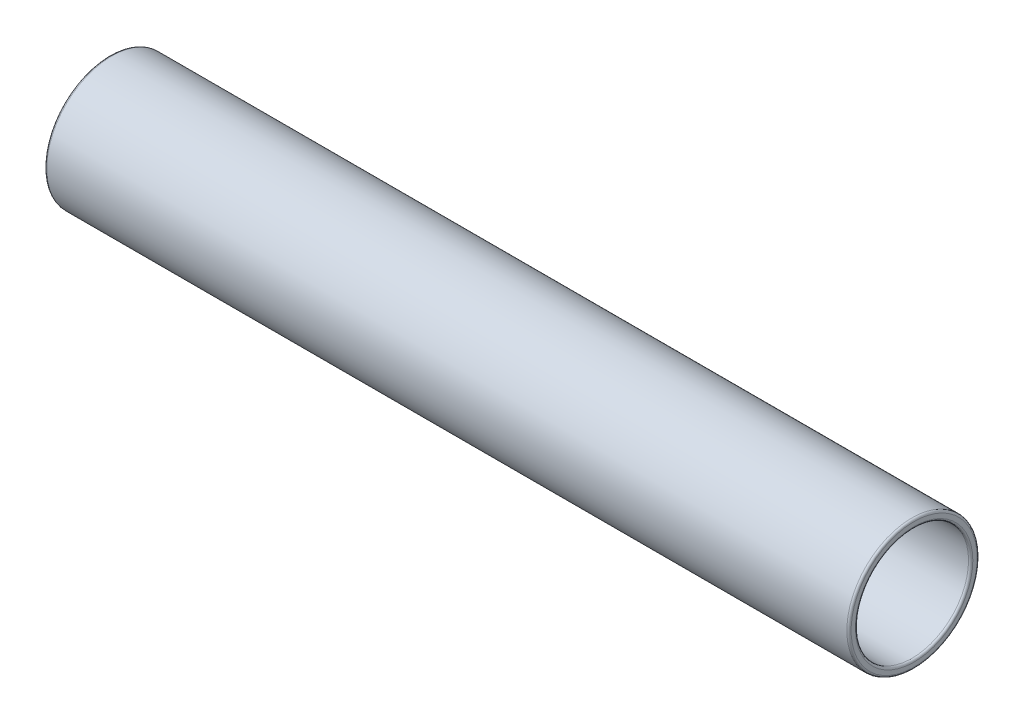
ISO-10303-21;
HEADER;
FILE_DESCRIPTION(('STEP AP214'),'2;1');
FILE_NAME('part.step','',(''),(''),'','','');
FILE_SCHEMA(('AUTOMOTIVE_DESIGN { 1 0 10303 214 1 1 1 1 }'));
ENDSEC;
DATA;
#1=APPLICATION_CONTEXT('core data for automotive mechanical design processes');
#2=APPLICATION_PROTOCOL_DEFINITION('international standard','automotive_design',2000,#1);
#3=PRODUCT_CONTEXT('',#1,'mechanical');
#4=PRODUCT('Part','Part','',(#3));
#5=PRODUCT_RELATED_PRODUCT_CATEGORY('part','',(#4));
#6=PRODUCT_DEFINITION_FORMATION('','',#4);
#7=PRODUCT_DEFINITION_CONTEXT('part definition',#1,'design');
#8=PRODUCT_DEFINITION('design','',#6,#7);
#9=PRODUCT_DEFINITION_SHAPE('','',#8);
#10=(LENGTH_UNIT() NAMED_UNIT(*) SI_UNIT(.MILLI.,.METRE.));
#11=(NAMED_UNIT(*) PLANE_ANGLE_UNIT() SI_UNIT($,.RADIAN.));
#12=(NAMED_UNIT(*) SI_UNIT($,.STERADIAN.) SOLID_ANGLE_UNIT());
#13=UNCERTAINTY_MEASURE_WITH_UNIT(LENGTH_MEASURE(1.E-05),#10,'distance_accuracy_value','');
#14=(GEOMETRIC_REPRESENTATION_CONTEXT(3) GLOBAL_UNCERTAINTY_ASSIGNED_CONTEXT((#13)) GLOBAL_UNIT_ASSIGNED_CONTEXT((#10,
#11,#12)) REPRESENTATION_CONTEXT('',''));
#15=CARTESIAN_POINT('',(0.,0.,0.));
#16=DIRECTION('',(0.,0.,1.));
#17=DIRECTION('',(1.,0.,0.));
#18=AXIS2_PLACEMENT_3D('',#15,#16,#17);
#19=CARTESIAN_POINT('',(750.,0.,0.));
#20=DIRECTION('',(1.,0.,0.));
#21=DIRECTION('',(0.,0.,-1.));
#22=AXIS2_PLACEMENT_3D('',#19,#20,#21);
#23=PLANE('',#22);
#24=CARTESIAN_POINT('',(750.,0.,0.));
#25=DIRECTION('',(1.,0.,0.));
#26=DIRECTION('',(0.,0.,-1.));
#27=AXIS2_PLACEMENT_3D('',#24,#25,#26);
#28=CIRCLE('',#27,54.75);
#29=CARTESIAN_POINT('',(750.,0.,-54.75));
#30=VERTEX_POINT('',#29);
#31=EDGE_CURVE('E65',#30,#30,#28,.F.);
#32=ORIENTED_EDGE('',*,*,#31,.T.);
#33=EDGE_LOOP('',(#32));
#34=FACE_BOUND('',#33,.T.);
#35=CARTESIAN_POINT('',(750.,0.,0.));
#36=DIRECTION('',(1.,0.,0.));
#37=DIRECTION('',(0.,0.,-1.));
#38=AXIS2_PLACEMENT_3D('',#35,#36,#37);
#39=CIRCLE('',#38,58.75);
#40=CARTESIAN_POINT('',(750.,0.,-58.75));
#41=VERTEX_POINT('',#40);
#42=EDGE_CURVE('E69',#41,#41,#39,.T.);
#43=ORIENTED_EDGE('',*,*,#42,.T.);
#44=EDGE_LOOP('',(#43));
#45=FACE_BOUND('',#44,.T.);
#46=ADVANCED_FACE('F37',(#34,#45),#23,.T.);
#47=CARTESIAN_POINT('',(0.,0.,0.));
#48=DIRECTION('',(1.,0.,0.));
#49=DIRECTION('',(0.,0.,-1.));
#50=AXIS2_PLACEMENT_3D('',#47,#48,#49);
#51=PLANE('',#50);
#52=CARTESIAN_POINT('',(0.,0.,0.));
#53=DIRECTION('',(1.,0.,0.));
#54=DIRECTION('',(0.,0.,-1.));
#55=AXIS2_PLACEMENT_3D('',#52,#53,#54);
#56=CIRCLE('',#55,54.75);
#57=CARTESIAN_POINT('',(0.,0.,-54.75));
#58=VERTEX_POINT('',#57);
#59=EDGE_CURVE('E50',#58,#58,#56,.T.);
#60=ORIENTED_EDGE('',*,*,#59,.T.);
#61=EDGE_LOOP('',(#60));
#62=FACE_BOUND('',#61,.T.);
#63=CARTESIAN_POINT('',(0.,0.,0.));
#64=DIRECTION('',(1.,0.,0.));
#65=DIRECTION('',(0.,0.,-1.));
#66=AXIS2_PLACEMENT_3D('',#63,#64,#65);
#67=CIRCLE('',#66,58.75);
#68=CARTESIAN_POINT('',(0.,0.,-58.75));
#69=VERTEX_POINT('',#68);
#70=EDGE_CURVE('E55',#69,#69,#67,.F.);
#71=ORIENTED_EDGE('',*,*,#70,.T.);
#72=EDGE_LOOP('',(#71));
#73=FACE_BOUND('',#72,.T.);
#74=ADVANCED_FACE('F97',(#62,#73),#51,.F.);
#75=CARTESIAN_POINT('',(750.,0.,0.));
#76=DIRECTION('',(-1.,0.,0.));
#77=DIRECTION('',(0.,0.,1.));
#78=AXIS2_PLACEMENT_3D('',#75,#76,#77);
#79=CYLINDRICAL_SURFACE('',#78,60.75);
#80=CARTESIAN_POINT('',(2.,0.,0.));
#81=DIRECTION('',(1.,0.,0.));
#82=DIRECTION('',(0.,0.,-1.));
#83=AXIS2_PLACEMENT_3D('',#80,#81,#82);
#84=CIRCLE('',#83,60.75);
#85=CARTESIAN_POINT('',(2.,0.,-60.75));
#86=VERTEX_POINT('',#85);
#87=EDGE_CURVE('E10',#86,#86,#84,.T.);
#88=ORIENTED_EDGE('',*,*,#87,.T.);
#89=EDGE_LOOP('',(#88));
#90=FACE_BOUND('',#89,.T.);
#91=CARTESIAN_POINT('',(748.,0.,0.));
#92=DIRECTION('',(1.,0.,0.));
#93=DIRECTION('',(0.,0.,-1.));
#94=AXIS2_PLACEMENT_3D('',#91,#92,#93);
#95=CIRCLE('',#94,60.75);
#96=CARTESIAN_POINT('',(748.,0.,-60.75));
#97=VERTEX_POINT('',#96);
#98=EDGE_CURVE('E61',#97,#97,#95,.F.);
#99=ORIENTED_EDGE('',*,*,#98,.T.);
#100=EDGE_LOOP('',(#99));
#101=FACE_BOUND('',#100,.T.);
#102=ADVANCED_FACE('F92',(#90,#101),#79,.T.);
#103=CARTESIAN_POINT('',(750.,0.,0.));
#104=DIRECTION('',(-1.,0.,0.));
#105=DIRECTION('',(0.,0.,1.));
#106=AXIS2_PLACEMENT_3D('',#103,#104,#105);
#107=CYLINDRICAL_SURFACE('',#106,52.75);
#108=CARTESIAN_POINT('',(2.,0.,0.));
#109=DIRECTION('',(1.,0.,0.));
#110=DIRECTION('',(0.,0.,-1.));
#111=AXIS2_PLACEMENT_3D('',#108,#109,#110);
#112=CIRCLE('',#111,52.75);
#113=CARTESIAN_POINT('',(2.,0.,-52.75));
#114=VERTEX_POINT('',#113);
#115=EDGE_CURVE('E45',#114,#114,#112,.F.);
#116=ORIENTED_EDGE('',*,*,#115,.T.);
#117=EDGE_LOOP('',(#116));
#118=FACE_BOUND('',#117,.T.);
#119=CARTESIAN_POINT('',(748.,0.,0.));
#120=DIRECTION('',(1.,0.,0.));
#121=DIRECTION('',(0.,0.,-1.));
#122=AXIS2_PLACEMENT_3D('',#119,#120,#121);
#123=CIRCLE('',#122,52.75);
#124=CARTESIAN_POINT('',(748.,0.,-52.75));
#125=VERTEX_POINT('',#124);
#126=EDGE_CURVE('E73',#125,#125,#123,.T.);
#127=ORIENTED_EDGE('',*,*,#126,.T.);
#128=EDGE_LOOP('',(#127));
#129=FACE_BOUND('',#128,.T.);
#130=ADVANCED_FACE('F78',(#118,#129),#107,.F.);
#131=CARTESIAN_POINT('',(748.,0.,0.));
#132=DIRECTION('',(1.,0.,0.));
#133=DIRECTION('',(0.,0.,-1.));
#134=AXIS2_PLACEMENT_3D('',#131,#132,#133);
#135=TOROIDAL_SURFACE('',#134,54.75,2.);
#136=ORIENTED_EDGE('',*,*,#31,.F.);
#137=EDGE_LOOP('',(#136));
#138=FACE_BOUND('',#137,.T.);
#139=ORIENTED_EDGE('',*,*,#126,.F.);
#140=EDGE_LOOP('',(#139));
#141=FACE_BOUND('',#140,.T.);
#142=ADVANCED_FACE('F80',(#138,#141),#135,.T.);
#143=CARTESIAN_POINT('',(748.,0.,0.));
#144=DIRECTION('',(1.,0.,0.));
#145=DIRECTION('',(0.,0.,-1.));
#146=AXIS2_PLACEMENT_3D('',#143,#144,#145);
#147=TOROIDAL_SURFACE('',#146,58.75,2.);
#148=ORIENTED_EDGE('',*,*,#98,.F.);
#149=EDGE_LOOP('',(#148));
#150=FACE_BOUND('',#149,.T.);
#151=ORIENTED_EDGE('',*,*,#42,.F.);
#152=EDGE_LOOP('',(#151));
#153=FACE_BOUND('',#152,.T.);
#154=ADVANCED_FACE('F82',(#150,#153),#147,.T.);
#155=CARTESIAN_POINT('',(2.,0.,0.));
#156=DIRECTION('',(1.,0.,0.));
#157=DIRECTION('',(0.,0.,-1.));
#158=AXIS2_PLACEMENT_3D('',#155,#156,#157);
#159=TOROIDAL_SURFACE('',#158,54.75,2.);
#160=ORIENTED_EDGE('',*,*,#115,.F.);
#161=EDGE_LOOP('',(#160));
#162=FACE_BOUND('',#161,.T.);
#163=ORIENTED_EDGE('',*,*,#59,.F.);
#164=EDGE_LOOP('',(#163));
#165=FACE_BOUND('',#164,.T.);
#166=ADVANCED_FACE('F89',(#162,#165),#159,.T.);
#167=CARTESIAN_POINT('',(2.,0.,0.));
#168=DIRECTION('',(1.,0.,0.));
#169=DIRECTION('',(0.,0.,-1.));
#170=AXIS2_PLACEMENT_3D('',#167,#168,#169);
#171=TOROIDAL_SURFACE('',#170,58.75,2.);
#172=ORIENTED_EDGE('',*,*,#70,.F.);
#173=EDGE_LOOP('',(#172));
#174=FACE_BOUND('',#173,.T.);
#175=ORIENTED_EDGE('',*,*,#87,.F.);
#176=EDGE_LOOP('',(#175));
#177=FACE_BOUND('',#176,.T.);
#178=ADVANCED_FACE('F39',(#174,#177),#171,.T.);
#179=CLOSED_SHELL('',(#46,#74,#102,#130,#142,#154,#166,#178));
#180=MANIFOLD_SOLID_BREP('B2',#179);
#181=ADVANCED_BREP_SHAPE_REPRESENTATION('',(#18,#180),#14);
#182=SHAPE_DEFINITION_REPRESENTATION(#9,#181);
ENDSEC;
END-ISO-10303-21;
